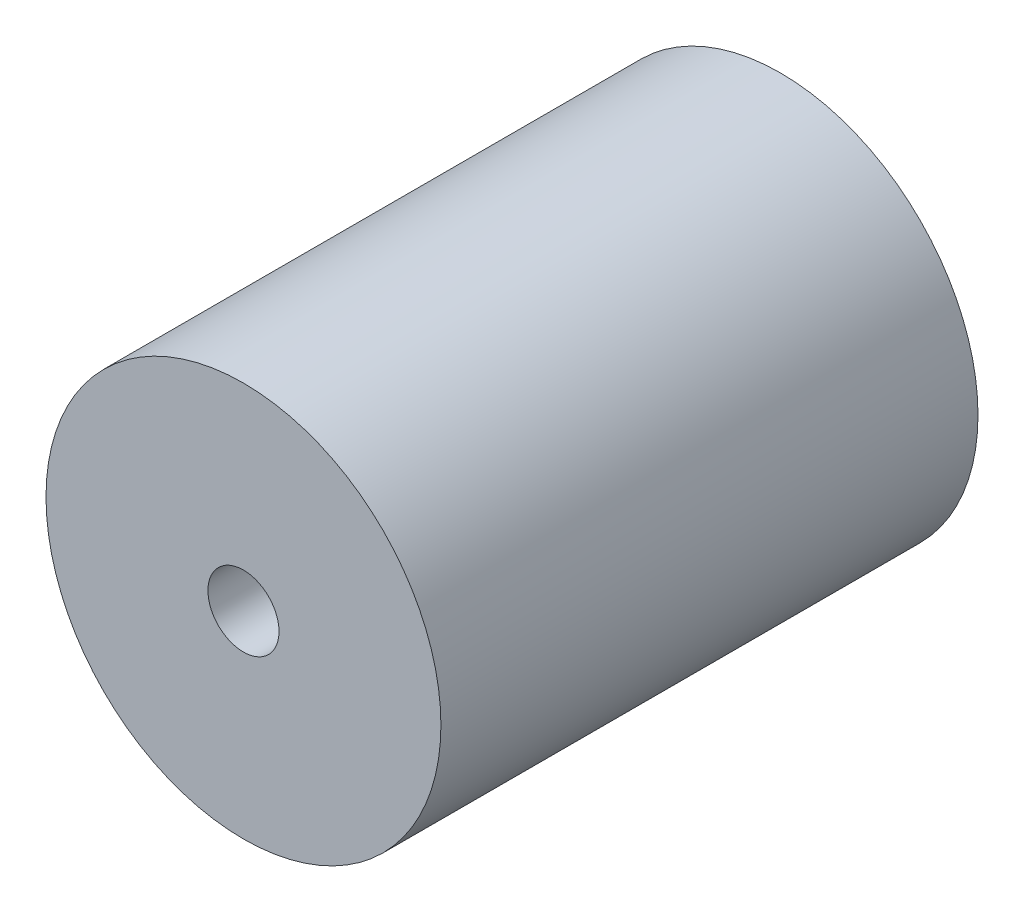
ISO-10303-21;
HEADER;
FILE_DESCRIPTION(('STEP AP214'),'2;1');
FILE_NAME('part.step','',(''),(''),'','','');
FILE_SCHEMA(('AUTOMOTIVE_DESIGN { 1 0 10303 214 1 1 1 1 }'));
ENDSEC;
DATA;
#1=APPLICATION_CONTEXT('core data for automotive mechanical design processes');
#2=APPLICATION_PROTOCOL_DEFINITION('international standard','automotive_design',2000,#1);
#3=PRODUCT_CONTEXT('',#1,'mechanical');
#4=PRODUCT('Part','Part','',(#3));
#5=PRODUCT_RELATED_PRODUCT_CATEGORY('part','',(#4));
#6=PRODUCT_DEFINITION_FORMATION('','',#4);
#7=PRODUCT_DEFINITION_CONTEXT('part definition',#1,'design');
#8=PRODUCT_DEFINITION('design','',#6,#7);
#9=PRODUCT_DEFINITION_SHAPE('','',#8);
#10=(LENGTH_UNIT() NAMED_UNIT(*) SI_UNIT(.MILLI.,.METRE.));
#11=(NAMED_UNIT(*) PLANE_ANGLE_UNIT() SI_UNIT($,.RADIAN.));
#12=(NAMED_UNIT(*) SI_UNIT($,.STERADIAN.) SOLID_ANGLE_UNIT());
#13=UNCERTAINTY_MEASURE_WITH_UNIT(LENGTH_MEASURE(1.E-05),#10,'distance_accuracy_value','');
#14=(GEOMETRIC_REPRESENTATION_CONTEXT(3) GLOBAL_UNCERTAINTY_ASSIGNED_CONTEXT((#13)) GLOBAL_UNIT_ASSIGNED_CONTEXT((#10,
#11,#12)) REPRESENTATION_CONTEXT('',''));
#15=CARTESIAN_POINT('',(0.,0.,0.));
#16=DIRECTION('',(0.,0.,1.));
#17=DIRECTION('',(1.,0.,0.));
#18=AXIS2_PLACEMENT_3D('',#15,#16,#17);
#19=CARTESIAN_POINT('',(0.,0.,34.));
#20=DIRECTION('',(0.,0.,-1.));
#21=DIRECTION('',(-1.,0.,0.));
#22=AXIS2_PLACEMENT_3D('',#19,#20,#21);
#23=CYLINDRICAL_SURFACE('',#22,12.5);
#24=CARTESIAN_POINT('',(0.,0.,34.));
#25=DIRECTION('',(0.,0.,1.));
#26=DIRECTION('',(1.,0.,0.));
#27=AXIS2_PLACEMENT_3D('',#24,#25,#26);
#28=CIRCLE('',#27,12.5);
#29=CARTESIAN_POINT('',(12.5,0.,34.));
#30=VERTEX_POINT('',#29);
#31=EDGE_CURVE('E10',#30,#30,#28,.T.);
#32=ORIENTED_EDGE('',*,*,#31,.F.);
#33=EDGE_LOOP('',(#32));
#34=FACE_BOUND('',#33,.T.);
#35=CARTESIAN_POINT('',(0.,0.,0.));
#36=DIRECTION('',(0.,0.,1.));
#37=DIRECTION('',(1.,0.,0.));
#38=AXIS2_PLACEMENT_3D('',#35,#36,#37);
#39=CIRCLE('',#38,12.5);
#40=CARTESIAN_POINT('',(12.5,0.,0.));
#41=VERTEX_POINT('',#40);
#42=EDGE_CURVE('E40',#41,#41,#39,.T.);
#43=ORIENTED_EDGE('',*,*,#42,.T.);
#44=EDGE_LOOP('',(#43));
#45=FACE_BOUND('',#44,.T.);
#46=ADVANCED_FACE('F37',(#34,#45),#23,.T.);
#47=CARTESIAN_POINT('',(0.,0.,34.));
#48=DIRECTION('',(0.,0.,1.));
#49=DIRECTION('',(1.,0.,0.));
#50=AXIS2_PLACEMENT_3D('',#47,#48,#49);
#51=PLANE('',#50);
#52=CARTESIAN_POINT('',(0.,0.,34.));
#53=DIRECTION('',(0.,0.,1.));
#54=DIRECTION('',(1.,0.,0.));
#55=AXIS2_PLACEMENT_3D('',#52,#53,#54);
#56=CIRCLE('',#55,2.25);
#57=CARTESIAN_POINT('',(2.25,0.,34.));
#58=VERTEX_POINT('',#57);
#59=EDGE_CURVE('E49',#58,#58,#56,.T.);
#60=ORIENTED_EDGE('',*,*,#59,.F.);
#61=EDGE_LOOP('',(#60));
#62=FACE_BOUND('',#61,.T.);
#63=ORIENTED_EDGE('',*,*,#31,.T.);
#64=EDGE_LOOP('',(#63));
#65=FACE_BOUND('',#64,.T.);
#66=ADVANCED_FACE('F74',(#62,#65),#51,.T.);
#67=CARTESIAN_POINT('',(0.,0.,0.));
#68=DIRECTION('',(0.,0.,1.));
#69=DIRECTION('',(1.,0.,0.));
#70=AXIS2_PLACEMENT_3D('',#67,#68,#69);
#71=PLANE('',#70);
#72=CARTESIAN_POINT('',(0.,0.,0.));
#73=DIRECTION('',(0.,0.,-1.));
#74=DIRECTION('',(-1.,0.,0.));
#75=AXIS2_PLACEMENT_3D('',#72,#73,#74);
#76=CIRCLE('',#75,4.);
#77=CARTESIAN_POINT('',(-4.,0.,0.));
#78=VERTEX_POINT('',#77);
#79=EDGE_CURVE('E55',#78,#78,#76,.T.);
#80=ORIENTED_EDGE('',*,*,#79,.F.);
#81=EDGE_LOOP('',(#80));
#82=FACE_BOUND('',#81,.T.);
#83=ORIENTED_EDGE('',*,*,#42,.F.);
#84=EDGE_LOOP('',(#83));
#85=FACE_BOUND('',#84,.T.);
#86=ADVANCED_FACE('F70',(#82,#85),#71,.F.);
#87=CARTESIAN_POINT('',(0.,0.,23.));
#88=DIRECTION('',(0.,0.,1.));
#89=DIRECTION('',(1.,0.,0.));
#90=AXIS2_PLACEMENT_3D('',#87,#88,#89);
#91=CYLINDRICAL_SURFACE('',#90,2.25);
#92=CARTESIAN_POINT('',(0.,0.,23.));
#93=DIRECTION('',(0.,0.,1.));
#94=DIRECTION('',(1.,0.,0.));
#95=AXIS2_PLACEMENT_3D('',#92,#93,#94);
#96=CIRCLE('',#95,2.25);
#97=CARTESIAN_POINT('',(2.25,0.,23.));
#98=VERTEX_POINT('',#97);
#99=EDGE_CURVE('E47',#98,#98,#96,.T.);
#100=ORIENTED_EDGE('',*,*,#99,.F.);
#101=EDGE_LOOP('',(#100));
#102=FACE_BOUND('',#101,.T.);
#103=ORIENTED_EDGE('',*,*,#59,.T.);
#104=EDGE_LOOP('',(#103));
#105=FACE_BOUND('',#104,.T.);
#106=ADVANCED_FACE('F73',(#102,#105),#91,.F.);
#107=CARTESIAN_POINT('',(0.,0.,23.));
#108=DIRECTION('',(0.,0.,1.));
#109=DIRECTION('',(1.,0.,0.));
#110=AXIS2_PLACEMENT_3D('',#107,#108,#109);
#111=PLANE('',#110);
#112=ORIENTED_EDGE('',*,*,#99,.T.);
#113=EDGE_LOOP('',(#112));
#114=FACE_BOUND('',#113,.T.);
#115=ADVANCED_FACE('F66',(#114),#111,.T.);
#116=CARTESIAN_POINT('',(0.,0.,11.));
#117=DIRECTION('',(0.,0.,-1.));
#118=DIRECTION('',(-1.,0.,0.));
#119=AXIS2_PLACEMENT_3D('',#116,#117,#118);
#120=CYLINDRICAL_SURFACE('',#119,4.);
#121=CARTESIAN_POINT('',(0.,0.,11.));
#122=DIRECTION('',(0.,0.,-1.));
#123=DIRECTION('',(-1.,0.,0.));
#124=AXIS2_PLACEMENT_3D('',#121,#122,#123);
#125=CIRCLE('',#124,4.);
#126=CARTESIAN_POINT('',(-4.,0.,11.));
#127=VERTEX_POINT('',#126);
#128=EDGE_CURVE('E52',#127,#127,#125,.T.);
#129=ORIENTED_EDGE('',*,*,#128,.F.);
#130=EDGE_LOOP('',(#129));
#131=FACE_BOUND('',#130,.T.);
#132=ORIENTED_EDGE('',*,*,#79,.T.);
#133=EDGE_LOOP('',(#132));
#134=FACE_BOUND('',#133,.T.);
#135=ADVANCED_FACE('F63',(#131,#134),#120,.F.);
#136=CARTESIAN_POINT('',(0.,0.,11.));
#137=DIRECTION('',(0.,0.,-1.));
#138=DIRECTION('',(-1.,0.,0.));
#139=AXIS2_PLACEMENT_3D('',#136,#137,#138);
#140=PLANE('',#139);
#141=ORIENTED_EDGE('',*,*,#128,.T.);
#142=EDGE_LOOP('',(#141));
#143=FACE_BOUND('',#142,.T.);
#144=ADVANCED_FACE('F61',(#143),#140,.T.);
#145=CLOSED_SHELL('',(#46,#66,#86,#106,#115,#135,#144));
#146=MANIFOLD_SOLID_BREP('B2',#145);
#147=ADVANCED_BREP_SHAPE_REPRESENTATION('',(#18,#146),#14);
#148=SHAPE_DEFINITION_REPRESENTATION(#9,#147);
ENDSEC;
END-ISO-10303-21;
